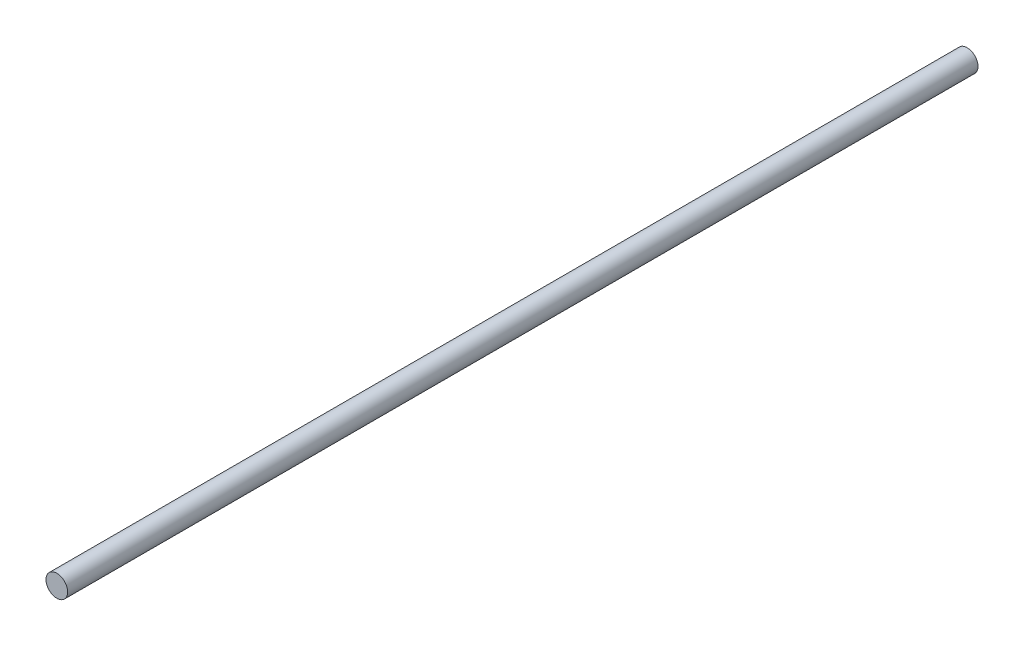
ISO-10303-21;
HEADER;
FILE_DESCRIPTION(('STEP AP214'),'2;1');
FILE_NAME('part.step','',(''),(''),'','','');
FILE_SCHEMA(('AUTOMOTIVE_DESIGN { 1 0 10303 214 1 1 1 1 }'));
ENDSEC;
DATA;
#1=APPLICATION_CONTEXT('core data for automotive mechanical design processes');
#2=APPLICATION_PROTOCOL_DEFINITION('international standard','automotive_design',2000,#1);
#3=PRODUCT_CONTEXT('',#1,'mechanical');
#4=PRODUCT('Part','Part','',(#3));
#5=PRODUCT_RELATED_PRODUCT_CATEGORY('part','',(#4));
#6=PRODUCT_DEFINITION_FORMATION('','',#4);
#7=PRODUCT_DEFINITION_CONTEXT('part definition',#1,'design');
#8=PRODUCT_DEFINITION('design','',#6,#7);
#9=PRODUCT_DEFINITION_SHAPE('','',#8);
#10=(LENGTH_UNIT() NAMED_UNIT(*) SI_UNIT(.MILLI.,.METRE.));
#11=(NAMED_UNIT(*) PLANE_ANGLE_UNIT() SI_UNIT($,.RADIAN.));
#12=(NAMED_UNIT(*) SI_UNIT($,.STERADIAN.) SOLID_ANGLE_UNIT());
#13=UNCERTAINTY_MEASURE_WITH_UNIT(LENGTH_MEASURE(1.E-05),#10,'distance_accuracy_value','');
#14=(GEOMETRIC_REPRESENTATION_CONTEXT(3) GLOBAL_UNCERTAINTY_ASSIGNED_CONTEXT((#13)) GLOBAL_UNIT_ASSIGNED_CONTEXT((#10,
#11,#12)) REPRESENTATION_CONTEXT('',''));
#15=CARTESIAN_POINT('',(0.,0.,0.));
#16=DIRECTION('',(0.,0.,1.));
#17=DIRECTION('',(1.,0.,0.));
#18=AXIS2_PLACEMENT_3D('',#15,#16,#17);
#19=CARTESIAN_POINT('',(0.,0.,420.));
#20=DIRECTION('',(0.,0.,-1.));
#21=DIRECTION('',(-1.,0.,0.));
#22=AXIS2_PLACEMENT_3D('',#19,#20,#21);
#23=CYLINDRICAL_SURFACE('',#22,5.);
#24=CARTESIAN_POINT('',(0.,0.,420.));
#25=DIRECTION('',(0.,0.,1.));
#26=DIRECTION('',(1.,0.,0.));
#27=AXIS2_PLACEMENT_3D('',#24,#25,#26);
#28=CIRCLE('',#27,5.);
#29=CARTESIAN_POINT('',(5.,0.,420.));
#30=VERTEX_POINT('',#29);
#31=EDGE_CURVE('E10',#30,#30,#28,.T.);
#32=ORIENTED_EDGE('',*,*,#31,.F.);
#33=EDGE_LOOP('',(#32));
#34=FACE_BOUND('',#33,.T.);
#35=CARTESIAN_POINT('',(0.,0.,0.));
#36=DIRECTION('',(0.,0.,1.));
#37=DIRECTION('',(1.,0.,0.));
#38=AXIS2_PLACEMENT_3D('',#35,#36,#37);
#39=CIRCLE('',#38,5.);
#40=CARTESIAN_POINT('',(5.,0.,0.));
#41=VERTEX_POINT('',#40);
#42=EDGE_CURVE('E34',#41,#41,#39,.T.);
#43=ORIENTED_EDGE('',*,*,#42,.T.);
#44=EDGE_LOOP('',(#43));
#45=FACE_BOUND('',#44,.T.);
#46=ADVANCED_FACE('F31',(#34,#45),#23,.T.);
#47=CARTESIAN_POINT('',(0.,0.,420.));
#48=DIRECTION('',(0.,0.,1.));
#49=DIRECTION('',(1.,0.,0.));
#50=AXIS2_PLACEMENT_3D('',#47,#48,#49);
#51=PLANE('',#50);
#52=ORIENTED_EDGE('',*,*,#31,.T.);
#53=EDGE_LOOP('',(#52));
#54=FACE_BOUND('',#53,.T.);
#55=ADVANCED_FACE('F46',(#54),#51,.T.);
#56=CARTESIAN_POINT('',(0.,0.,0.));
#57=DIRECTION('',(0.,0.,1.));
#58=DIRECTION('',(1.,0.,0.));
#59=AXIS2_PLACEMENT_3D('',#56,#57,#58);
#60=PLANE('',#59);
#61=ORIENTED_EDGE('',*,*,#42,.F.);
#62=EDGE_LOOP('',(#61));
#63=FACE_BOUND('',#62,.T.);
#64=ADVANCED_FACE('F44',(#63),#60,.F.);
#65=CLOSED_SHELL('',(#46,#55,#64));
#66=MANIFOLD_SOLID_BREP('B2',#65);
#67=ADVANCED_BREP_SHAPE_REPRESENTATION('',(#18,#66),#14);
#68=SHAPE_DEFINITION_REPRESENTATION(#9,#67);
ENDSEC;
END-ISO-10303-21;
